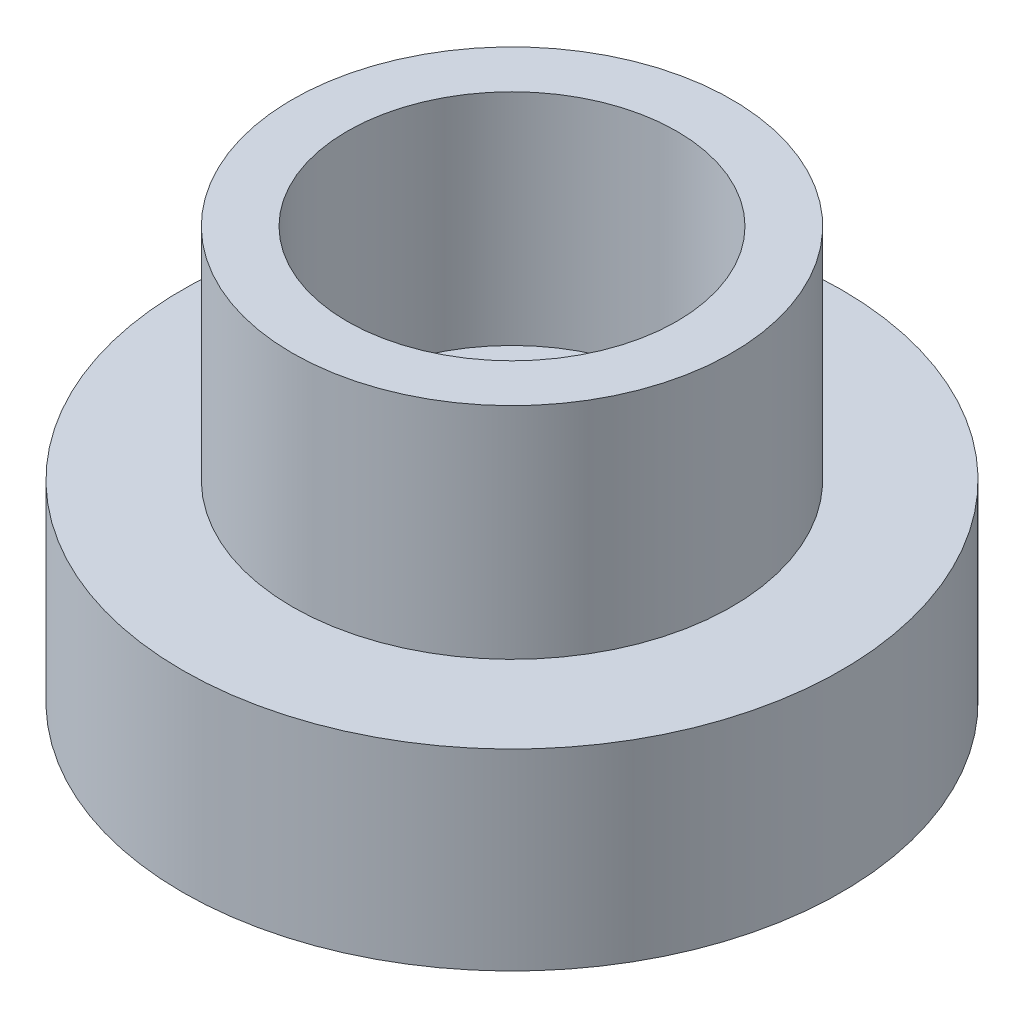
ISO-10303-21;
HEADER;
FILE_DESCRIPTION(('STEP AP214'),'2;1');
FILE_NAME('part.step','',(''),(''),'','','');
FILE_SCHEMA(('AUTOMOTIVE_DESIGN { 1 0 10303 214 1 1 1 1 }'));
ENDSEC;
DATA;
#1=APPLICATION_CONTEXT('core data for automotive mechanical design processes');
#2=APPLICATION_PROTOCOL_DEFINITION('international standard','automotive_design',2000,#1);
#3=PRODUCT_CONTEXT('',#1,'mechanical');
#4=PRODUCT('Part','Part','',(#3));
#5=PRODUCT_RELATED_PRODUCT_CATEGORY('part','',(#4));
#6=PRODUCT_DEFINITION_FORMATION('','',#4);
#7=PRODUCT_DEFINITION_CONTEXT('part definition',#1,'design');
#8=PRODUCT_DEFINITION('design','',#6,#7);
#9=PRODUCT_DEFINITION_SHAPE('','',#8);
#10=(LENGTH_UNIT() NAMED_UNIT(*) SI_UNIT(.MILLI.,.METRE.));
#11=(NAMED_UNIT(*) PLANE_ANGLE_UNIT() SI_UNIT($,.RADIAN.));
#12=(NAMED_UNIT(*) SI_UNIT($,.STERADIAN.) SOLID_ANGLE_UNIT());
#13=UNCERTAINTY_MEASURE_WITH_UNIT(LENGTH_MEASURE(1.E-05),#10,'distance_accuracy_value','');
#14=(GEOMETRIC_REPRESENTATION_CONTEXT(3) GLOBAL_UNCERTAINTY_ASSIGNED_CONTEXT((#13)) GLOBAL_UNIT_ASSIGNED_CONTEXT((#10,
#11,#12)) REPRESENTATION_CONTEXT('',''));
#15=CARTESIAN_POINT('',(0.,0.,0.));
#16=DIRECTION('',(0.,0.,1.));
#17=DIRECTION('',(1.,0.,0.));
#18=AXIS2_PLACEMENT_3D('',#15,#16,#17);
#19=CARTESIAN_POINT('',(0.,22.225,0.));
#20=DIRECTION('',(0.,1.,0.));
#21=DIRECTION('',(0.,0.,1.));
#22=AXIS2_PLACEMENT_3D('',#19,#20,#21);
#23=PLANE('',#22);
#24=CARTESIAN_POINT('',(0.,22.225,0.));
#25=DIRECTION('',(0.,1.,0.));
#26=DIRECTION('',(0.,0.,1.));
#27=AXIS2_PLACEMENT_3D('',#24,#25,#26);
#28=CIRCLE('',#27,38.1);
#29=CARTESIAN_POINT('',(0.,22.225,38.1));
#30=VERTEX_POINT('',#29);
#31=EDGE_CURVE('E77',#30,#30,#28,.T.);
#32=ORIENTED_EDGE('',*,*,#31,.T.);
#33=EDGE_LOOP('',(#32));
#34=FACE_BOUND('',#33,.T.);
#35=CARTESIAN_POINT('',(0.,22.225,0.));
#36=DIRECTION('',(0.,1.,0.));
#37=DIRECTION('',(0.,0.,1.));
#38=AXIS2_PLACEMENT_3D('',#35,#36,#37);
#39=CIRCLE('',#38,25.4);
#40=CARTESIAN_POINT('',(0.,22.225,25.4));
#41=VERTEX_POINT('',#40);
#42=EDGE_CURVE('E87',#41,#41,#39,.T.);
#43=ORIENTED_EDGE('',*,*,#42,.F.);
#44=EDGE_LOOP('',(#43));
#45=FACE_BOUND('',#44,.T.);
#46=ADVANCED_FACE('F33',(#34,#45),#23,.T.);
#47=CARTESIAN_POINT('',(0.,0.,0.));
#48=DIRECTION('',(0.,1.,0.));
#49=DIRECTION('',(0.,0.,1.));
#50=AXIS2_PLACEMENT_3D('',#47,#48,#49);
#51=PLANE('',#50);
#52=CARTESIAN_POINT('',(-34.29,0.,3.59168685326793E-13));
#53=DIRECTION('',(0.,-1.,0.));
#54=DIRECTION('',(0.,0.,-1.));
#55=AXIS2_PLACEMENT_3D('',#52,#53,#54);
#56=CIRCLE('',#55,1.64973);
#57=CARTESIAN_POINT('',(-34.29,0.,-1.64972999999964));
#58=VERTEX_POINT('',#57);
#59=EDGE_CURVE('E69',#58,#58,#56,.T.);
#60=ORIENTED_EDGE('',*,*,#59,.F.);
#61=EDGE_LOOP('',(#60));
#62=FACE_BOUND('',#61,.T.);
#63=CARTESIAN_POINT('',(-2.39445790217862E-13,0.,-34.29));
#64=DIRECTION('',(0.,-1.,0.));
#65=DIRECTION('',(0.,0.,-1.));
#66=AXIS2_PLACEMENT_3D('',#63,#64,#65);
#67=CIRCLE('',#66,1.64973);
#68=CARTESIAN_POINT('',(-2.39445790217862E-13,0.,-35.93973));
#69=VERTEX_POINT('',#68);
#70=EDGE_CURVE('E63',#69,#69,#67,.T.);
#71=ORIENTED_EDGE('',*,*,#70,.F.);
#72=EDGE_LOOP('',(#71));
#73=FACE_BOUND('',#72,.T.);
#74=CARTESIAN_POINT('',(34.29,0.,-1.19722895108931E-13));
#75=DIRECTION('',(0.,-1.,0.));
#76=DIRECTION('',(0.,0.,-1.));
#77=AXIS2_PLACEMENT_3D('',#74,#75,#76);
#78=CIRCLE('',#77,1.64973);
#79=CARTESIAN_POINT('',(34.29,0.,-1.64973000000012));
#80=VERTEX_POINT('',#79);
#81=EDGE_CURVE('E57',#80,#80,#78,.T.);
#82=ORIENTED_EDGE('',*,*,#81,.F.);
#83=EDGE_LOOP('',(#82));
#84=FACE_BOUND('',#83,.T.);
#85=CARTESIAN_POINT('',(0.,0.,34.29));
#86=DIRECTION('',(0.,-1.,0.));
#87=DIRECTION('',(0.,0.,-1.));
#88=AXIS2_PLACEMENT_3D('',#85,#86,#87);
#89=CIRCLE('',#88,1.64973);
#90=CARTESIAN_POINT('',(0.,0.,32.64027));
#91=VERTEX_POINT('',#90);
#92=EDGE_CURVE('E51',#91,#91,#89,.T.);
#93=ORIENTED_EDGE('',*,*,#92,.F.);
#94=EDGE_LOOP('',(#93));
#95=FACE_BOUND('',#94,.T.);
#96=CARTESIAN_POINT('',(0.,0.,0.));
#97=DIRECTION('',(0.,1.,0.));
#98=DIRECTION('',(0.,0.,1.));
#99=AXIS2_PLACEMENT_3D('',#96,#97,#98);
#100=CIRCLE('',#99,38.1);
#101=CARTESIAN_POINT('',(0.,0.,38.1));
#102=VERTEX_POINT('',#101);
#103=EDGE_CURVE('E40',#102,#102,#100,.T.);
#104=ORIENTED_EDGE('',*,*,#103,.F.);
#105=EDGE_LOOP('',(#104));
#106=FACE_BOUND('',#105,.T.);
#107=CARTESIAN_POINT('',(0.,0.,0.));
#108=DIRECTION('',(0.,1.,0.));
#109=DIRECTION('',(0.,0.,1.));
#110=AXIS2_PLACEMENT_3D('',#107,#108,#109);
#111=CIRCLE('',#110,31.115);
#112=CARTESIAN_POINT('',(0.,0.,31.115));
#113=VERTEX_POINT('',#112);
#114=EDGE_CURVE('E44',#113,#113,#111,.T.);
#115=ORIENTED_EDGE('',*,*,#114,.T.);
#116=EDGE_LOOP('',(#115));
#117=FACE_BOUND('',#116,.T.);
#118=ADVANCED_FACE('F115',(#62,#73,#84,#95,#106,#117),#51,.F.);
#119=CARTESIAN_POINT('',(0.,19.05,0.));
#120=DIRECTION('',(0.,-1.,0.));
#121=DIRECTION('',(0.,0.,-1.));
#122=AXIS2_PLACEMENT_3D('',#119,#120,#121);
#123=CYLINDRICAL_SURFACE('',#122,38.1);
#124=ORIENTED_EDGE('',*,*,#103,.T.);
#125=EDGE_LOOP('',(#124));
#126=FACE_BOUND('',#125,.T.);
#127=ORIENTED_EDGE('',*,*,#31,.F.);
#128=EDGE_LOOP('',(#127));
#129=FACE_BOUND('',#128,.T.);
#130=ADVANCED_FACE('F35',(#126,#129),#123,.T.);
#131=CARTESIAN_POINT('',(0.,19.05,0.));
#132=DIRECTION('',(0.,-1.,0.));
#133=DIRECTION('',(0.,0.,-1.));
#134=AXIS2_PLACEMENT_3D('',#131,#132,#133);
#135=CYLINDRICAL_SURFACE('',#134,31.115);
#136=CARTESIAN_POINT('',(0.,19.05,0.));
#137=DIRECTION('',(0.,1.,0.));
#138=DIRECTION('',(0.,0.,1.));
#139=AXIS2_PLACEMENT_3D('',#136,#137,#138);
#140=CIRCLE('',#139,31.115);
#141=CARTESIAN_POINT('',(0.,19.05,31.115));
#142=VERTEX_POINT('',#141);
#143=EDGE_CURVE('E72',#142,#142,#140,.T.);
#144=ORIENTED_EDGE('',*,*,#143,.T.);
#145=EDGE_LOOP('',(#144));
#146=FACE_BOUND('',#145,.T.);
#147=ORIENTED_EDGE('',*,*,#114,.F.);
#148=EDGE_LOOP('',(#147));
#149=FACE_BOUND('',#148,.T.);
#150=ADVANCED_FACE('F170',(#146,#149),#135,.F.);
#151=CARTESIAN_POINT('',(0.,12.7,34.29));
#152=DIRECTION('',(0.,-1.,0.));
#153=DIRECTION('',(0.,0.,-1.));
#154=AXIS2_PLACEMENT_3D('',#151,#152,#153);
#155=CYLINDRICAL_SURFACE('',#154,1.64973);
#156=CARTESIAN_POINT('',(0.,12.7,34.29));
#157=DIRECTION('',(0.,-1.,0.));
#158=DIRECTION('',(0.,0.,-1.));
#159=AXIS2_PLACEMENT_3D('',#156,#157,#158);
#160=CIRCLE('',#159,1.64973);
#161=CARTESIAN_POINT('',(0.,12.7,32.64027));
#162=VERTEX_POINT('',#161);
#163=EDGE_CURVE('E48',#162,#162,#160,.T.);
#164=ORIENTED_EDGE('',*,*,#163,.F.);
#165=EDGE_LOOP('',(#164));
#166=FACE_BOUND('',#165,.T.);
#167=ORIENTED_EDGE('',*,*,#92,.T.);
#168=EDGE_LOOP('',(#167));
#169=FACE_BOUND('',#168,.T.);
#170=ADVANCED_FACE('F166',(#166,#169),#155,.F.);
#171=CARTESIAN_POINT('',(0.,12.7,34.29));
#172=DIRECTION('',(0.,-1.,0.));
#173=DIRECTION('',(0.,0.,-1.));
#174=AXIS2_PLACEMENT_3D('',#171,#172,#173);
#175=PLANE('',#174);
#176=ORIENTED_EDGE('',*,*,#163,.T.);
#177=EDGE_LOOP('',(#176));
#178=FACE_BOUND('',#177,.T.);
#179=ADVANCED_FACE('F162',(#178),#175,.T.);
#180=CARTESIAN_POINT('',(34.29,12.7,-1.19722895108931E-13));
#181=DIRECTION('',(0.,-1.,0.));
#182=DIRECTION('',(0.,0.,-1.));
#183=AXIS2_PLACEMENT_3D('',#180,#181,#182);
#184=CYLINDRICAL_SURFACE('',#183,1.64973);
#185=CARTESIAN_POINT('',(34.29,12.7,-1.19722895108931E-13));
#186=DIRECTION('',(0.,-1.,0.));
#187=DIRECTION('',(0.,0.,-1.));
#188=AXIS2_PLACEMENT_3D('',#185,#186,#187);
#189=CIRCLE('',#188,1.64973);
#190=CARTESIAN_POINT('',(34.29,12.7,-1.64973000000012));
#191=VERTEX_POINT('',#190);
#192=EDGE_CURVE('E54',#191,#191,#189,.T.);
#193=ORIENTED_EDGE('',*,*,#192,.F.);
#194=EDGE_LOOP('',(#193));
#195=FACE_BOUND('',#194,.T.);
#196=ORIENTED_EDGE('',*,*,#81,.T.);
#197=EDGE_LOOP('',(#196));
#198=FACE_BOUND('',#197,.T.);
#199=ADVANCED_FACE('F158',(#195,#198),#184,.F.);
#200=CARTESIAN_POINT('',(34.29,12.7,-1.19722895108931E-13));
#201=DIRECTION('',(0.,-1.,0.));
#202=DIRECTION('',(0.,0.,-1.));
#203=AXIS2_PLACEMENT_3D('',#200,#201,#202);
#204=PLANE('',#203);
#205=ORIENTED_EDGE('',*,*,#192,.T.);
#206=EDGE_LOOP('',(#205));
#207=FACE_BOUND('',#206,.T.);
#208=ADVANCED_FACE('F154',(#207),#204,.T.);
#209=CARTESIAN_POINT('',(-2.39445790217862E-13,12.7,-34.29));
#210=DIRECTION('',(0.,-1.,0.));
#211=DIRECTION('',(0.,0.,-1.));
#212=AXIS2_PLACEMENT_3D('',#209,#210,#211);
#213=CYLINDRICAL_SURFACE('',#212,1.64973);
#214=CARTESIAN_POINT('',(-2.39445790217862E-13,12.7,-34.29));
#215=DIRECTION('',(0.,-1.,0.));
#216=DIRECTION('',(0.,0.,-1.));
#217=AXIS2_PLACEMENT_3D('',#214,#215,#216);
#218=CIRCLE('',#217,1.64973);
#219=CARTESIAN_POINT('',(-2.39445790217862E-13,12.7,-35.93973));
#220=VERTEX_POINT('',#219);
#221=EDGE_CURVE('E60',#220,#220,#218,.T.);
#222=ORIENTED_EDGE('',*,*,#221,.F.);
#223=EDGE_LOOP('',(#222));
#224=FACE_BOUND('',#223,.T.);
#225=ORIENTED_EDGE('',*,*,#70,.T.);
#226=EDGE_LOOP('',(#225));
#227=FACE_BOUND('',#226,.T.);
#228=ADVANCED_FACE('F150',(#224,#227),#213,.F.);
#229=CARTESIAN_POINT('',(-2.39445790217862E-13,12.7,-34.29));
#230=DIRECTION('',(0.,-1.,0.));
#231=DIRECTION('',(0.,0.,-1.));
#232=AXIS2_PLACEMENT_3D('',#229,#230,#231);
#233=PLANE('',#232);
#234=ORIENTED_EDGE('',*,*,#221,.T.);
#235=EDGE_LOOP('',(#234));
#236=FACE_BOUND('',#235,.T.);
#237=ADVANCED_FACE('F144',(#236),#233,.T.);
#238=CARTESIAN_POINT('',(-34.29,12.7,3.59168685326793E-13));
#239=DIRECTION('',(0.,-1.,0.));
#240=DIRECTION('',(0.,0.,-1.));
#241=AXIS2_PLACEMENT_3D('',#238,#239,#240);
#242=CYLINDRICAL_SURFACE('',#241,1.64973);
#243=CARTESIAN_POINT('',(-34.29,12.7,3.59168685326793E-13));
#244=DIRECTION('',(0.,-1.,0.));
#245=DIRECTION('',(0.,0.,-1.));
#246=AXIS2_PLACEMENT_3D('',#243,#244,#245);
#247=CIRCLE('',#246,1.64973);
#248=CARTESIAN_POINT('',(-34.29,12.7,-1.64972999999964));
#249=VERTEX_POINT('',#248);
#250=EDGE_CURVE('E66',#249,#249,#247,.T.);
#251=ORIENTED_EDGE('',*,*,#250,.F.);
#252=EDGE_LOOP('',(#251));
#253=FACE_BOUND('',#252,.T.);
#254=ORIENTED_EDGE('',*,*,#59,.T.);
#255=EDGE_LOOP('',(#254));
#256=FACE_BOUND('',#255,.T.);
#257=ADVANCED_FACE('F133',(#253,#256),#242,.F.);
#258=CARTESIAN_POINT('',(-34.29,12.7,3.59168685326793E-13));
#259=DIRECTION('',(0.,-1.,0.));
#260=DIRECTION('',(0.,0.,-1.));
#261=AXIS2_PLACEMENT_3D('',#258,#259,#260);
#262=PLANE('',#261);
#263=ORIENTED_EDGE('',*,*,#250,.T.);
#264=EDGE_LOOP('',(#263));
#265=FACE_BOUND('',#264,.T.);
#266=ADVANCED_FACE('F126',(#265),#262,.T.);
#267=CARTESIAN_POINT('',(0.,22.225,0.));
#268=DIRECTION('',(0.,1.,0.));
#269=DIRECTION('',(0.,0.,1.));
#270=AXIS2_PLACEMENT_3D('',#267,#268,#269);
#271=CIRCLE('',#270,19.05);
#272=CARTESIAN_POINT('',(0.,22.225,19.05));
#273=VERTEX_POINT('',#272);
#274=EDGE_CURVE('E10',#273,#273,#271,.F.);
#275=ORIENTED_EDGE('',*,*,#274,.F.);
#276=EDGE_LOOP('',(#275));
#277=FACE_BOUND('',#276,.T.);
#278=CARTESIAN_POINT('',(0.,22.225,0.));
#279=DIRECTION('',(0.,1.,0.));
#280=DIRECTION('',(0.,0.,1.));
#281=AXIS2_PLACEMENT_3D('',#278,#279,#280);
#282=CIRCLE('',#281,12.7);
#283=CARTESIAN_POINT('',(0.,22.225,12.7));
#284=VERTEX_POINT('',#283);
#285=EDGE_CURVE('E80',#284,#284,#282,.T.);
#286=ORIENTED_EDGE('',*,*,#285,.F.);
#287=EDGE_LOOP('',(#286));
#288=FACE_BOUND('',#287,.T.);
#289=ADVANCED_FACE('F118',(#277,#288),#23,.T.);
#290=CARTESIAN_POINT('',(0.,19.05,0.));
#291=DIRECTION('',(0.,1.,0.));
#292=DIRECTION('',(0.,0.,1.));
#293=AXIS2_PLACEMENT_3D('',#290,#291,#292);
#294=PLANE('',#293);
#295=ORIENTED_EDGE('',*,*,#143,.F.);
#296=EDGE_LOOP('',(#295));
#297=FACE_BOUND('',#296,.T.);
#298=CARTESIAN_POINT('',(0.,19.05,0.));
#299=DIRECTION('',(0.,1.,0.));
#300=DIRECTION('',(0.,0.,1.));
#301=AXIS2_PLACEMENT_3D('',#298,#299,#300);
#302=CIRCLE('',#301,12.7);
#303=CARTESIAN_POINT('',(0.,19.05,12.7));
#304=VERTEX_POINT('',#303);
#305=EDGE_CURVE('E81',#304,#304,#302,.T.);
#306=ORIENTED_EDGE('',*,*,#305,.T.);
#307=EDGE_LOOP('',(#306));
#308=FACE_BOUND('',#307,.T.);
#309=ADVANCED_FACE('F110',(#297,#308),#294,.F.);
#310=CARTESIAN_POINT('',(0.,22.225,0.));
#311=DIRECTION('',(0.,-1.,0.));
#312=DIRECTION('',(0.,0.,-1.));
#313=AXIS2_PLACEMENT_3D('',#310,#311,#312);
#314=CYLINDRICAL_SURFACE('',#313,12.7);
#315=ORIENTED_EDGE('',*,*,#285,.T.);
#316=EDGE_LOOP('',(#315));
#317=FACE_BOUND('',#316,.T.);
#318=ORIENTED_EDGE('',*,*,#305,.F.);
#319=EDGE_LOOP('',(#318));
#320=FACE_BOUND('',#319,.T.);
#321=ADVANCED_FACE('F101',(#317,#320),#314,.F.);
#322=CARTESIAN_POINT('',(0.,47.625,0.));
#323=DIRECTION('',(0.,1.,0.));
#324=DIRECTION('',(0.,0.,1.));
#325=AXIS2_PLACEMENT_3D('',#322,#323,#324);
#326=PLANE('',#325);
#327=CARTESIAN_POINT('',(0.,47.625,0.));
#328=DIRECTION('',(0.,1.,0.));
#329=DIRECTION('',(0.,0.,1.));
#330=AXIS2_PLACEMENT_3D('',#327,#328,#329);
#331=CIRCLE('',#330,25.4);
#332=CARTESIAN_POINT('',(0.,47.625,25.4));
#333=VERTEX_POINT('',#332);
#334=EDGE_CURVE('E84',#333,#333,#331,.T.);
#335=ORIENTED_EDGE('',*,*,#334,.T.);
#336=EDGE_LOOP('',(#335));
#337=FACE_BOUND('',#336,.T.);
#338=CARTESIAN_POINT('',(0.,47.625,0.));
#339=DIRECTION('',(0.,1.,0.));
#340=DIRECTION('',(0.,0.,1.));
#341=AXIS2_PLACEMENT_3D('',#338,#339,#340);
#342=CIRCLE('',#341,19.05);
#343=CARTESIAN_POINT('',(0.,47.625,19.05));
#344=VERTEX_POINT('',#343);
#345=EDGE_CURVE('E90',#344,#344,#342,.T.);
#346=ORIENTED_EDGE('',*,*,#345,.F.);
#347=EDGE_LOOP('',(#346));
#348=FACE_BOUND('',#347,.T.);
#349=ADVANCED_FACE('F98',(#337,#348),#326,.T.);
#350=CARTESIAN_POINT('',(0.,47.625,0.));
#351=DIRECTION('',(0.,-1.,0.));
#352=DIRECTION('',(0.,0.,-1.));
#353=AXIS2_PLACEMENT_3D('',#350,#351,#352);
#354=CYLINDRICAL_SURFACE('',#353,25.4);
#355=ORIENTED_EDGE('',*,*,#334,.F.);
#356=EDGE_LOOP('',(#355));
#357=FACE_BOUND('',#356,.T.);
#358=ORIENTED_EDGE('',*,*,#42,.T.);
#359=EDGE_LOOP('',(#358));
#360=FACE_BOUND('',#359,.T.);
#361=ADVANCED_FACE('F100',(#357,#360),#354,.T.);
#362=CARTESIAN_POINT('',(0.,47.625,0.));
#363=DIRECTION('',(0.,-1.,0.));
#364=DIRECTION('',(0.,0.,-1.));
#365=AXIS2_PLACEMENT_3D('',#362,#363,#364);
#366=CYLINDRICAL_SURFACE('',#365,19.05);
#367=ORIENTED_EDGE('',*,*,#345,.T.);
#368=EDGE_LOOP('',(#367));
#369=FACE_BOUND('',#368,.T.);
#370=ORIENTED_EDGE('',*,*,#274,.T.);
#371=EDGE_LOOP('',(#370));
#372=FACE_BOUND('',#371,.T.);
#373=ADVANCED_FACE('F96',(#369,#372),#366,.F.);
#374=CLOSED_SHELL('',(#46,#118,#130,#150,#170,#179,#199,#208,#228,#237,#257,#266,#289,#309,#321,
#349,#361,#373));
#375=MANIFOLD_SOLID_BREP('B2',#374);
#376=ADVANCED_BREP_SHAPE_REPRESENTATION('',(#18,#375),#14);
#377=SHAPE_DEFINITION_REPRESENTATION(#9,#376);
ENDSEC;
END-ISO-10303-21;
